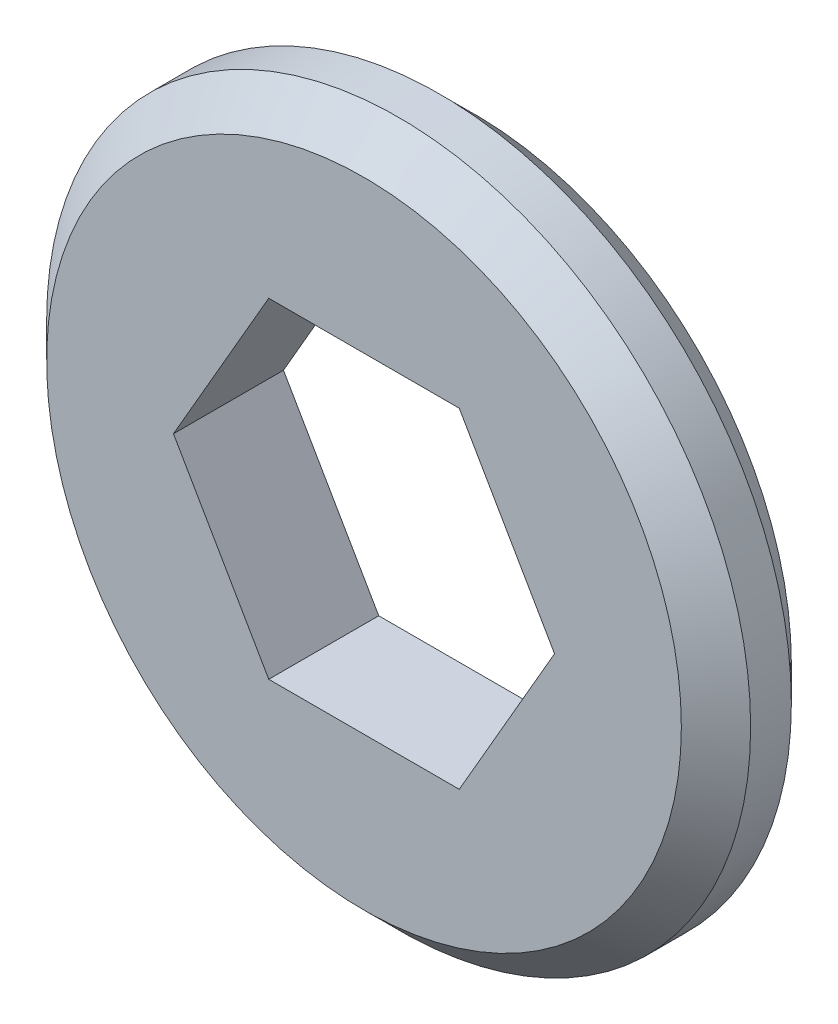
ISO-10303-21;
HEADER;
FILE_DESCRIPTION(('STEP AP214'),'2;1');
FILE_NAME('part.step','',(''),(''),'','','');
FILE_SCHEMA(('AUTOMOTIVE_DESIGN { 1 0 10303 214 1 1 1 1 }'));
ENDSEC;
DATA;
#1=APPLICATION_CONTEXT('core data for automotive mechanical design processes');
#2=APPLICATION_PROTOCOL_DEFINITION('international standard','automotive_design',2000,#1);
#3=PRODUCT_CONTEXT('',#1,'mechanical');
#4=PRODUCT('Part','Part','',(#3));
#5=PRODUCT_RELATED_PRODUCT_CATEGORY('part','',(#4));
#6=PRODUCT_DEFINITION_FORMATION('','',#4);
#7=PRODUCT_DEFINITION_CONTEXT('part definition',#1,'design');
#8=PRODUCT_DEFINITION('design','',#6,#7);
#9=PRODUCT_DEFINITION_SHAPE('','',#8);
#10=(LENGTH_UNIT() NAMED_UNIT(*) SI_UNIT(.MILLI.,.METRE.));
#11=(NAMED_UNIT(*) PLANE_ANGLE_UNIT() SI_UNIT($,.RADIAN.));
#12=(NAMED_UNIT(*) SI_UNIT($,.STERADIAN.) SOLID_ANGLE_UNIT());
#13=UNCERTAINTY_MEASURE_WITH_UNIT(LENGTH_MEASURE(1.E-05),#10,'distance_accuracy_value','');
#14=(GEOMETRIC_REPRESENTATION_CONTEXT(3) GLOBAL_UNCERTAINTY_ASSIGNED_CONTEXT((#13)) GLOBAL_UNIT_ASSIGNED_CONTEXT((#10,
#11,#12)) REPRESENTATION_CONTEXT('',''));
#15=CARTESIAN_POINT('',(0.,0.,0.));
#16=DIRECTION('',(0.,0.,1.));
#17=DIRECTION('',(1.,0.,0.));
#18=AXIS2_PLACEMENT_3D('',#15,#16,#17);
#19=CARTESIAN_POINT('',(0.,0.,3.175));
#20=DIRECTION('',(0.,0.,1.));
#21=DIRECTION('',(1.,0.,0.));
#22=AXIS2_PLACEMENT_3D('',#19,#20,#21);
#23=PLANE('',#22);
#24=CARTESIAN_POINT('',(0.,0.,3.175));
#25=DIRECTION('',(0.,0.,1.));
#26=DIRECTION('',(1.,0.,0.));
#27=AXIS2_PLACEMENT_3D('',#24,#25,#26);
#28=CIRCLE('',#27,9.16);
#29=CARTESIAN_POINT('',(9.16,0.,3.175));
#30=VERTEX_POINT('',#29);
#31=EDGE_CURVE('E11',#30,#30,#28,.T.);
#32=ORIENTED_EDGE('',*,*,#31,.T.);
#33=EDGE_LOOP('',(#32));
#34=FACE_BOUND('',#33,.T.);
#35=DIRECTION('',(-0.5,0.866025403784439,0.));
#36=VECTOR('',#35,1.);
#37=CARTESIAN_POINT('',(5.49926131403118,0.,3.175));
#38=LINE('',#37,#36);
#39=CARTESIAN_POINT('',(5.49926131403118,0.,3.175));
#40=VERTEX_POINT('',#39);
#41=CARTESIAN_POINT('',(2.74963065701559,4.76250000000001,3.175));
#42=VERTEX_POINT('',#41);
#43=EDGE_CURVE('E104',#40,#42,#38,.T.);
#44=ORIENTED_EDGE('',*,*,#43,.F.);
#45=DIRECTION('',(0.5,0.866025403784439,0.));
#46=VECTOR('',#45,1.);
#47=CARTESIAN_POINT('',(2.74963065701559,-4.7625,3.175));
#48=LINE('',#47,#46);
#49=CARTESIAN_POINT('',(2.74963065701559,-4.7625,3.175));
#50=VERTEX_POINT('',#49);
#51=EDGE_CURVE('E95',#50,#40,#48,.T.);
#52=ORIENTED_EDGE('',*,*,#51,.F.);
#53=DIRECTION('',(1.,0.,0.));
#54=VECTOR('',#53,1.);
#55=CARTESIAN_POINT('',(-2.74963065701559,-4.7625,3.175));
#56=LINE('',#55,#54);
#57=CARTESIAN_POINT('',(-2.74963065701559,-4.7625,3.175));
#58=VERTEX_POINT('',#57);
#59=EDGE_CURVE('E130',#58,#50,#56,.T.);
#60=ORIENTED_EDGE('',*,*,#59,.F.);
#61=DIRECTION('',(0.5,-0.866025403784439,0.));
#62=VECTOR('',#61,1.);
#63=CARTESIAN_POINT('',(-5.49926131403119,0.,3.175));
#64=LINE('',#63,#62);
#65=CARTESIAN_POINT('',(-5.49926131403119,0.,3.175));
#66=VERTEX_POINT('',#65);
#67=EDGE_CURVE('E127',#66,#58,#64,.T.);
#68=ORIENTED_EDGE('',*,*,#67,.F.);
#69=DIRECTION('',(-0.5,-0.866025403784439,0.));
#70=VECTOR('',#69,1.);
#71=CARTESIAN_POINT('',(-2.74963065701559,4.76250000000001,3.175));
#72=LINE('',#71,#70);
#73=CARTESIAN_POINT('',(-2.74963065701559,4.76250000000001,3.175));
#74=VERTEX_POINT('',#73);
#75=EDGE_CURVE('E122',#74,#66,#72,.T.);
#76=ORIENTED_EDGE('',*,*,#75,.F.);
#77=DIRECTION('',(-1.,0.,0.));
#78=VECTOR('',#77,1.);
#79=CARTESIAN_POINT('',(2.74963065701559,4.76250000000001,3.175));
#80=LINE('',#79,#78);
#81=EDGE_CURVE('E118',#42,#74,#80,.T.);
#82=ORIENTED_EDGE('',*,*,#81,.F.);
#83=EDGE_LOOP('',(#44,#52,#60,#68,#76,#82));
#84=FACE_BOUND('',#83,.T.);
#85=ADVANCED_FACE('F41',(#34,#84),#23,.T.);
#86=CARTESIAN_POINT('',(0.,0.,0.));
#87=DIRECTION('',(0.,0.,1.));
#88=DIRECTION('',(1.,0.,0.));
#89=AXIS2_PLACEMENT_3D('',#86,#87,#88);
#90=PLANE('',#89);
#91=CARTESIAN_POINT('',(0.,0.,0.));
#92=DIRECTION('',(0.,0.,1.));
#93=DIRECTION('',(1.,0.,0.));
#94=AXIS2_PLACEMENT_3D('',#91,#92,#93);
#95=CIRCLE('',#94,9.15999999999999);
#96=CARTESIAN_POINT('',(9.15999999999999,0.,0.));
#97=VERTEX_POINT('',#96);
#98=EDGE_CURVE('E50',#97,#97,#95,.F.);
#99=ORIENTED_EDGE('',*,*,#98,.T.);
#100=EDGE_LOOP('',(#99));
#101=FACE_BOUND('',#100,.T.);
#102=DIRECTION('',(0.5,0.866025403784439,0.));
#103=VECTOR('',#102,1.);
#104=CARTESIAN_POINT('',(2.74963065701559,-4.7625,0.));
#105=LINE('',#104,#103);
#106=CARTESIAN_POINT('',(2.74963065701559,-4.7625,0.));
#107=VERTEX_POINT('',#106);
#108=CARTESIAN_POINT('',(5.49926131403118,0.,0.));
#109=VERTEX_POINT('',#108);
#110=EDGE_CURVE('E65',#107,#109,#105,.T.);
#111=ORIENTED_EDGE('',*,*,#110,.T.);
#112=DIRECTION('',(-0.5,0.866025403784439,0.));
#113=VECTOR('',#112,1.);
#114=CARTESIAN_POINT('',(5.49926131403118,0.,0.));
#115=LINE('',#114,#113);
#116=CARTESIAN_POINT('',(2.74963065701559,4.76250000000001,0.));
#117=VERTEX_POINT('',#116);
#118=EDGE_CURVE('E111',#109,#117,#115,.T.);
#119=ORIENTED_EDGE('',*,*,#118,.T.);
#120=DIRECTION('',(-1.,0.,0.));
#121=VECTOR('',#120,1.);
#122=CARTESIAN_POINT('',(2.74963065701559,4.76250000000001,0.));
#123=LINE('',#122,#121);
#124=CARTESIAN_POINT('',(-2.74963065701559,4.76250000000001,0.));
#125=VERTEX_POINT('',#124);
#126=EDGE_CURVE('E137',#117,#125,#123,.T.);
#127=ORIENTED_EDGE('',*,*,#126,.T.);
#128=DIRECTION('',(-0.5,-0.866025403784439,0.));
#129=VECTOR('',#128,1.);
#130=CARTESIAN_POINT('',(-2.74963065701559,4.76250000000001,0.));
#131=LINE('',#130,#129);
#132=CARTESIAN_POINT('',(-5.49926131403119,0.,0.));
#133=VERTEX_POINT('',#132);
#134=EDGE_CURVE('E141',#125,#133,#131,.T.);
#135=ORIENTED_EDGE('',*,*,#134,.T.);
#136=DIRECTION('',(0.5,-0.866025403784439,0.));
#137=VECTOR('',#136,1.);
#138=CARTESIAN_POINT('',(-5.49926131403119,0.,0.));
#139=LINE('',#138,#137);
#140=CARTESIAN_POINT('',(-2.74963065701559,-4.7625,0.));
#141=VERTEX_POINT('',#140);
#142=EDGE_CURVE('E145',#133,#141,#139,.T.);
#143=ORIENTED_EDGE('',*,*,#142,.T.);
#144=DIRECTION('',(1.,0.,0.));
#145=VECTOR('',#144,1.);
#146=CARTESIAN_POINT('',(-2.74963065701559,-4.7625,0.));
#147=LINE('',#146,#145);
#148=EDGE_CURVE('E105',#141,#107,#147,.T.);
#149=ORIENTED_EDGE('',*,*,#148,.T.);
#150=EDGE_LOOP('',(#111,#119,#127,#135,#143,#149));
#151=FACE_BOUND('',#150,.T.);
#152=ADVANCED_FACE('F174',(#101,#151),#90,.F.);
#153=CARTESIAN_POINT('',(0.,0.,3.175));
#154=DIRECTION('',(0.,0.,-1.));
#155=DIRECTION('',(-1.,0.,0.));
#156=AXIS2_PLACEMENT_3D('',#153,#154,#155);
#157=CYLINDRICAL_SURFACE('',#156,10.16);
#158=CARTESIAN_POINT('',(0.,0.,1.));
#159=DIRECTION('',(0.,0.,1.));
#160=DIRECTION('',(1.,0.,0.));
#161=AXIS2_PLACEMENT_3D('',#158,#159,#160);
#162=CIRCLE('',#161,10.16);
#163=CARTESIAN_POINT('',(10.16,0.,1.));
#164=VERTEX_POINT('',#163);
#165=EDGE_CURVE('E167',#164,#164,#162,.T.);
#166=ORIENTED_EDGE('',*,*,#165,.T.);
#167=EDGE_LOOP('',(#166));
#168=FACE_BOUND('',#167,.T.);
#169=CARTESIAN_POINT('',(0.,0.,2.17499999999999));
#170=DIRECTION('',(0.,0.,1.));
#171=DIRECTION('',(1.,0.,0.));
#172=AXIS2_PLACEMENT_3D('',#169,#170,#171);
#173=CIRCLE('',#172,10.16);
#174=CARTESIAN_POINT('',(10.16,0.,2.17499999999999));
#175=VERTEX_POINT('',#174);
#176=EDGE_CURVE('E113',#175,#175,#173,.F.);
#177=ORIENTED_EDGE('',*,*,#176,.T.);
#178=EDGE_LOOP('',(#177));
#179=FACE_BOUND('',#178,.T.);
#180=ADVANCED_FACE('F183',(#168,#179),#157,.T.);
#181=CARTESIAN_POINT('',(2.74963065701559,-4.7625,3.175));
#182=DIRECTION('',(-0.866025403784439,0.5,0.));
#183=DIRECTION('',(-0.5,-0.866025403784439,0.));
#184=AXIS2_PLACEMENT_3D('',#181,#182,#183);
#185=PLANE('',#184);
#186=ORIENTED_EDGE('',*,*,#110,.F.);
#187=DIRECTION('',(0.,0.,-1.));
#188=VECTOR('',#187,1.);
#189=CARTESIAN_POINT('',(2.74963065701559,-4.7625,3.175));
#190=LINE('',#189,#188);
#191=EDGE_CURVE('E99',#50,#107,#190,.T.);
#192=ORIENTED_EDGE('',*,*,#191,.F.);
#193=ORIENTED_EDGE('',*,*,#51,.T.);
#194=DIRECTION('',(0.,0.,-1.));
#195=VECTOR('',#194,1.);
#196=CARTESIAN_POINT('',(5.49926131403118,0.,3.175));
#197=LINE('',#196,#195);
#198=EDGE_CURVE('E98',#40,#109,#197,.T.);
#199=ORIENTED_EDGE('',*,*,#198,.T.);
#200=EDGE_LOOP('',(#186,#192,#193,#199));
#201=FACE_BOUND('',#200,.T.);
#202=ADVANCED_FACE('F97',(#201),#185,.T.);
#203=CARTESIAN_POINT('',(5.49926131403118,0.,3.175));
#204=DIRECTION('',(-0.866025403784439,-0.5,0.));
#205=DIRECTION('',(0.5,-0.866025403784439,0.));
#206=AXIS2_PLACEMENT_3D('',#203,#204,#205);
#207=PLANE('',#206);
#208=ORIENTED_EDGE('',*,*,#118,.F.);
#209=ORIENTED_EDGE('',*,*,#198,.F.);
#210=ORIENTED_EDGE('',*,*,#43,.T.);
#211=DIRECTION('',(0.,0.,-1.));
#212=VECTOR('',#211,1.);
#213=CARTESIAN_POINT('',(2.74963065701559,4.76250000000001,3.175));
#214=LINE('',#213,#212);
#215=EDGE_CURVE('E114',#42,#117,#214,.T.);
#216=ORIENTED_EDGE('',*,*,#215,.T.);
#217=EDGE_LOOP('',(#208,#209,#210,#216));
#218=FACE_BOUND('',#217,.T.);
#219=ADVANCED_FACE('F108',(#218),#207,.T.);
#220=CARTESIAN_POINT('',(2.74963065701559,4.76250000000001,3.175));
#221=DIRECTION('',(0.,-1.,0.));
#222=DIRECTION('',(0.,0.,-1.));
#223=AXIS2_PLACEMENT_3D('',#220,#221,#222);
#224=PLANE('',#223);
#225=ORIENTED_EDGE('',*,*,#126,.F.);
#226=ORIENTED_EDGE('',*,*,#215,.F.);
#227=ORIENTED_EDGE('',*,*,#81,.T.);
#228=DIRECTION('',(0.,0.,-1.));
#229=VECTOR('',#228,1.);
#230=CARTESIAN_POINT('',(-2.74963065701559,4.76250000000001,3.175));
#231=LINE('',#230,#229);
#232=EDGE_CURVE('E159',#74,#125,#231,.T.);
#233=ORIENTED_EDGE('',*,*,#232,.T.);
#234=EDGE_LOOP('',(#225,#226,#227,#233));
#235=FACE_BOUND('',#234,.T.);
#236=ADVANCED_FACE('F204',(#235),#224,.T.);
#237=CARTESIAN_POINT('',(-2.74963065701559,4.76250000000001,3.175));
#238=DIRECTION('',(0.866025403784439,-0.5,0.));
#239=DIRECTION('',(0.5,0.866025403784439,0.));
#240=AXIS2_PLACEMENT_3D('',#237,#238,#239);
#241=PLANE('',#240);
#242=ORIENTED_EDGE('',*,*,#134,.F.);
#243=ORIENTED_EDGE('',*,*,#232,.F.);
#244=ORIENTED_EDGE('',*,*,#75,.T.);
#245=DIRECTION('',(0.,0.,-1.));
#246=VECTOR('',#245,1.);
#247=CARTESIAN_POINT('',(-5.49926131403119,0.,3.175));
#248=LINE('',#247,#246);
#249=EDGE_CURVE('E156',#66,#133,#248,.T.);
#250=ORIENTED_EDGE('',*,*,#249,.T.);
#251=EDGE_LOOP('',(#242,#243,#244,#250));
#252=FACE_BOUND('',#251,.T.);
#253=ADVANCED_FACE('F207',(#252),#241,.T.);
#254=CARTESIAN_POINT('',(-5.49926131403119,0.,3.175));
#255=DIRECTION('',(0.866025403784439,0.5,0.));
#256=DIRECTION('',(-0.5,0.866025403784439,0.));
#257=AXIS2_PLACEMENT_3D('',#254,#255,#256);
#258=PLANE('',#257);
#259=ORIENTED_EDGE('',*,*,#142,.F.);
#260=ORIENTED_EDGE('',*,*,#249,.F.);
#261=ORIENTED_EDGE('',*,*,#67,.T.);
#262=DIRECTION('',(0.,0.,-1.));
#263=VECTOR('',#262,1.);
#264=CARTESIAN_POINT('',(-2.74963065701559,-4.7625,3.175));
#265=LINE('',#264,#263);
#266=EDGE_CURVE('E57',#58,#141,#265,.T.);
#267=ORIENTED_EDGE('',*,*,#266,.T.);
#268=EDGE_LOOP('',(#259,#260,#261,#267));
#269=FACE_BOUND('',#268,.T.);
#270=ADVANCED_FACE('F211',(#269),#258,.T.);
#271=CARTESIAN_POINT('',(-2.74963065701559,-4.7625,3.175));
#272=DIRECTION('',(0.,1.,0.));
#273=DIRECTION('',(-1.,0.,0.));
#274=AXIS2_PLACEMENT_3D('',#271,#272,#273);
#275=PLANE('',#274);
#276=ORIENTED_EDGE('',*,*,#148,.F.);
#277=ORIENTED_EDGE('',*,*,#266,.F.);
#278=ORIENTED_EDGE('',*,*,#59,.T.);
#279=ORIENTED_EDGE('',*,*,#191,.T.);
#280=EDGE_LOOP('',(#276,#277,#278,#279));
#281=FACE_BOUND('',#280,.T.);
#282=ADVANCED_FACE('F180',(#281),#275,.T.);
#283=CARTESIAN_POINT('',(0.,0.,1.));
#284=DIRECTION('',(0.,0.,1.));
#285=DIRECTION('',(1.,0.,0.));
#286=AXIS2_PLACEMENT_3D('',#283,#284,#285);
#287=CONICAL_SURFACE('',#286,10.16,0.785398163397451);
#288=ORIENTED_EDGE('',*,*,#98,.F.);
#289=EDGE_LOOP('',(#288));
#290=FACE_BOUND('',#289,.T.);
#291=ORIENTED_EDGE('',*,*,#165,.F.);
#292=EDGE_LOOP('',(#291));
#293=FACE_BOUND('',#292,.T.);
#294=ADVANCED_FACE('F177',(#290,#293),#287,.T.);
#295=CARTESIAN_POINT('',(0.,0.,3.175));
#296=DIRECTION('',(0.,0.,-1.));
#297=DIRECTION('',(-1.,0.,0.));
#298=AXIS2_PLACEMENT_3D('',#295,#296,#297);
#299=CONICAL_SURFACE('',#298,9.16,0.785398163397447);
#300=ORIENTED_EDGE('',*,*,#176,.F.);
#301=EDGE_LOOP('',(#300));
#302=FACE_BOUND('',#301,.T.);
#303=ORIENTED_EDGE('',*,*,#31,.F.);
#304=EDGE_LOOP('',(#303));
#305=FACE_BOUND('',#304,.T.);
#306=ADVANCED_FACE('F43',(#302,#305),#299,.T.);
#307=CLOSED_SHELL('',(#85,#152,#180,#202,#219,#236,#253,#270,#282,#294,#306));
#308=MANIFOLD_SOLID_BREP('B2',#307);
#309=ADVANCED_BREP_SHAPE_REPRESENTATION('',(#18,#308),#14);
#310=SHAPE_DEFINITION_REPRESENTATION(#9,#309);
ENDSEC;
END-ISO-10303-21;
